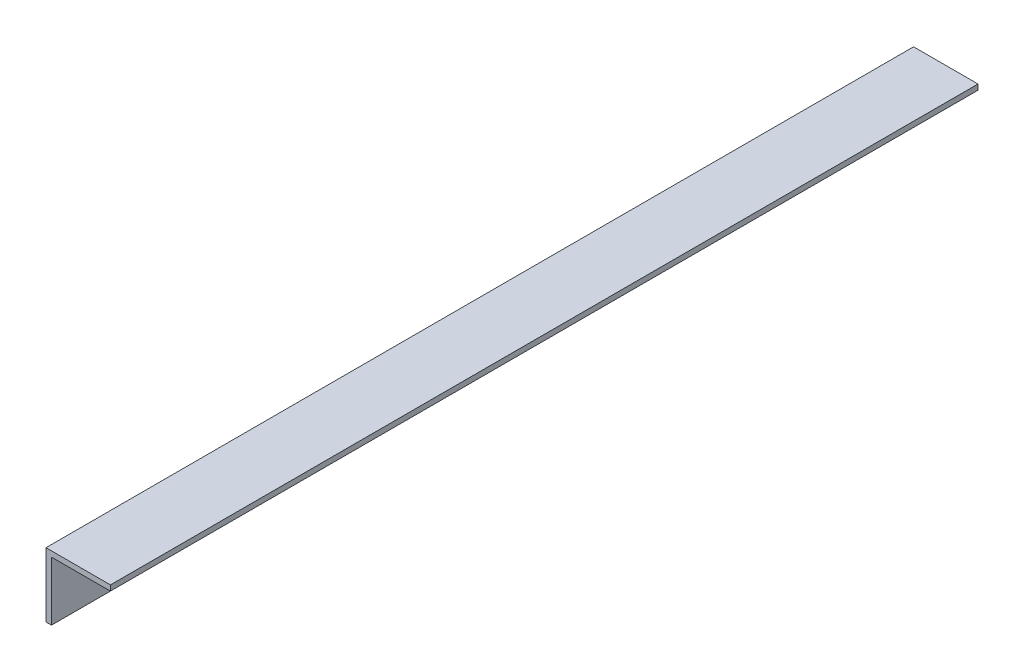
ISO-10303-21;
HEADER;
FILE_DESCRIPTION(('STEP AP214'),'2;1');
FILE_NAME('part.step','',(''),(''),'','','');
FILE_SCHEMA(('AUTOMOTIVE_DESIGN { 1 0 10303 214 1 1 1 1 }'));
ENDSEC;
DATA;
#1=APPLICATION_CONTEXT('core data for automotive mechanical design processes');
#2=APPLICATION_PROTOCOL_DEFINITION('international standard','automotive_design',2000,#1);
#3=PRODUCT_CONTEXT('',#1,'mechanical');
#4=PRODUCT('Part','Part','',(#3));
#5=PRODUCT_RELATED_PRODUCT_CATEGORY('part','',(#4));
#6=PRODUCT_DEFINITION_FORMATION('','',#4);
#7=PRODUCT_DEFINITION_CONTEXT('part definition',#1,'design');
#8=PRODUCT_DEFINITION('design','',#6,#7);
#9=PRODUCT_DEFINITION_SHAPE('','',#8);
#10=(LENGTH_UNIT() NAMED_UNIT(*) SI_UNIT(.MILLI.,.METRE.));
#11=(NAMED_UNIT(*) PLANE_ANGLE_UNIT() SI_UNIT($,.RADIAN.));
#12=(NAMED_UNIT(*) SI_UNIT($,.STERADIAN.) SOLID_ANGLE_UNIT());
#13=UNCERTAINTY_MEASURE_WITH_UNIT(LENGTH_MEASURE(1.E-05),#10,'distance_accuracy_value','');
#14=(GEOMETRIC_REPRESENTATION_CONTEXT(3) GLOBAL_UNCERTAINTY_ASSIGNED_CONTEXT((#13)) GLOBAL_UNIT_ASSIGNED_CONTEXT((#10,
#11,#12)) REPRESENTATION_CONTEXT('',''));
#15=CARTESIAN_POINT('',(0.,0.,0.));
#16=DIRECTION('',(0.,0.,1.));
#17=DIRECTION('',(1.,0.,0.));
#18=AXIS2_PLACEMENT_3D('',#15,#16,#17);
#19=CARTESIAN_POINT('',(0.,-1.6002,256.54));
#20=DIRECTION('',(-1.,0.,0.));
#21=DIRECTION('',(0.,0.,1.));
#22=AXIS2_PLACEMENT_3D('',#19,#20,#21);
#23=PLANE('',#22);
#24=DIRECTION('',(0.,1.,0.));
#25=VECTOR('',#24,1.);
#26=CARTESIAN_POINT('',(0.,-1.6002,0.));
#27=LINE('',#26,#25);
#28=CARTESIAN_POINT('',(0.,-1.6002,0.));
#29=VERTEX_POINT('',#28);
#30=CARTESIAN_POINT('',(0.,0.,0.));
#31=VERTEX_POINT('',#30);
#32=EDGE_CURVE('E119',#29,#31,#27,.T.);
#33=ORIENTED_EDGE('',*,*,#32,.T.);
#34=DIRECTION('',(0.,0.,-1.));
#35=VECTOR('',#34,1.);
#36=CARTESIAN_POINT('',(0.,0.,256.54));
#37=LINE('',#36,#35);
#38=CARTESIAN_POINT('',(0.,0.,256.54));
#39=VERTEX_POINT('',#38);
#40=EDGE_CURVE('E11',#39,#31,#37,.T.);
#41=ORIENTED_EDGE('',*,*,#40,.F.);
#42=DIRECTION('',(0.,1.,0.));
#43=VECTOR('',#42,1.);
#44=CARTESIAN_POINT('',(0.,-1.6002,256.54));
#45=LINE('',#44,#43);
#46=CARTESIAN_POINT('',(0.,-1.6002,256.54));
#47=VERTEX_POINT('',#46);
#48=EDGE_CURVE('E129',#47,#39,#45,.T.);
#49=ORIENTED_EDGE('',*,*,#48,.F.);
#50=DIRECTION('',(0.,0.,-1.));
#51=VECTOR('',#50,1.);
#52=CARTESIAN_POINT('',(0.,-1.6002,256.54));
#53=LINE('',#52,#51);
#54=EDGE_CURVE('E115',#47,#29,#53,.T.);
#55=ORIENTED_EDGE('',*,*,#54,.T.);
#56=EDGE_LOOP('',(#33,#41,#49,#55));
#57=FACE_BOUND('',#56,.T.);
#58=ADVANCED_FACE('F35',(#57),#23,.F.);
#59=CARTESIAN_POINT('',(0.,0.,256.54));
#60=DIRECTION('',(0.,-1.,0.));
#61=DIRECTION('',(1.,0.,0.));
#62=AXIS2_PLACEMENT_3D('',#59,#60,#61);
#63=PLANE('',#62);
#64=DIRECTION('',(-1.,0.,0.));
#65=VECTOR('',#64,1.);
#66=CARTESIAN_POINT('',(0.,0.,0.));
#67=LINE('',#66,#65);
#68=CARTESIAN_POINT('',(-19.05,0.,0.));
#69=VERTEX_POINT('',#68);
#70=EDGE_CURVE('E122',#31,#69,#67,.T.);
#71=ORIENTED_EDGE('',*,*,#70,.T.);
#72=DIRECTION('',(0.,0.,-1.));
#73=VECTOR('',#72,1.);
#74=CARTESIAN_POINT('',(-19.05,0.,256.54));
#75=LINE('',#74,#73);
#76=CARTESIAN_POINT('',(-19.05,0.,256.54));
#77=VERTEX_POINT('',#76);
#78=EDGE_CURVE('E43',#77,#69,#75,.T.);
#79=ORIENTED_EDGE('',*,*,#78,.F.);
#80=DIRECTION('',(-1.,0.,0.));
#81=VECTOR('',#80,1.);
#82=CARTESIAN_POINT('',(0.,0.,256.54));
#83=LINE('',#82,#81);
#84=EDGE_CURVE('E88',#39,#77,#83,.T.);
#85=ORIENTED_EDGE('',*,*,#84,.F.);
#86=ORIENTED_EDGE('',*,*,#40,.T.);
#87=EDGE_LOOP('',(#71,#79,#85,#86));
#88=FACE_BOUND('',#87,.T.);
#89=ADVANCED_FACE('F153',(#88),#63,.F.);
#90=CARTESIAN_POINT('',(-19.05,0.,256.54));
#91=DIRECTION('',(1.,0.,0.));
#92=DIRECTION('',(0.,1.,0.));
#93=AXIS2_PLACEMENT_3D('',#90,#91,#92);
#94=PLANE('',#93);
#95=DIRECTION('',(0.,-1.,0.));
#96=VECTOR('',#95,1.);
#97=CARTESIAN_POINT('',(-19.05,0.,0.));
#98=LINE('',#97,#96);
#99=CARTESIAN_POINT('',(-19.05,-19.05,0.));
#100=VERTEX_POINT('',#99);
#101=EDGE_CURVE('E124',#69,#100,#98,.T.);
#102=ORIENTED_EDGE('',*,*,#101,.T.);
#103=DIRECTION('',(0.,0.,-1.));
#104=VECTOR('',#103,1.);
#105=CARTESIAN_POINT('',(-19.05,-19.05,256.54));
#106=LINE('',#105,#104);
#107=CARTESIAN_POINT('',(-19.05,-19.05,256.54));
#108=VERTEX_POINT('',#107);
#109=EDGE_CURVE('E110',#108,#100,#106,.T.);
#110=ORIENTED_EDGE('',*,*,#109,.F.);
#111=DIRECTION('',(0.,-1.,0.));
#112=VECTOR('',#111,1.);
#113=CARTESIAN_POINT('',(-19.05,0.,256.54));
#114=LINE('',#113,#112);
#115=EDGE_CURVE('E101',#77,#108,#114,.T.);
#116=ORIENTED_EDGE('',*,*,#115,.F.);
#117=ORIENTED_EDGE('',*,*,#78,.T.);
#118=EDGE_LOOP('',(#102,#110,#116,#117));
#119=FACE_BOUND('',#118,.T.);
#120=ADVANCED_FACE('F135',(#119),#94,.F.);
#121=CARTESIAN_POINT('',(-19.05,-19.05,256.54));
#122=DIRECTION('',(0.,1.,0.));
#123=DIRECTION('',(0.,0.,1.));
#124=AXIS2_PLACEMENT_3D('',#121,#122,#123);
#125=PLANE('',#124);
#126=DIRECTION('',(1.,0.,0.));
#127=VECTOR('',#126,1.);
#128=CARTESIAN_POINT('',(-19.05,-19.05,0.));
#129=LINE('',#128,#127);
#130=CARTESIAN_POINT('',(-17.4498,-19.05,0.));
#131=VERTEX_POINT('',#130);
#132=EDGE_CURVE('E109',#100,#131,#129,.T.);
#133=ORIENTED_EDGE('',*,*,#132,.T.);
#134=DIRECTION('',(0.,0.,-1.));
#135=VECTOR('',#134,1.);
#136=CARTESIAN_POINT('',(-17.4498,-19.05,256.54));
#137=LINE('',#136,#135);
#138=CARTESIAN_POINT('',(-17.4498,-19.05,256.54));
#139=VERTEX_POINT('',#138);
#140=EDGE_CURVE('E106',#139,#131,#137,.T.);
#141=ORIENTED_EDGE('',*,*,#140,.F.);
#142=DIRECTION('',(1.,0.,0.));
#143=VECTOR('',#142,1.);
#144=CARTESIAN_POINT('',(-19.05,-19.05,256.54));
#145=LINE('',#144,#143);
#146=EDGE_CURVE('E95',#108,#139,#145,.T.);
#147=ORIENTED_EDGE('',*,*,#146,.F.);
#148=ORIENTED_EDGE('',*,*,#109,.T.);
#149=EDGE_LOOP('',(#133,#141,#147,#148));
#150=FACE_BOUND('',#149,.T.);
#151=ADVANCED_FACE('F107',(#150),#125,.F.);
#152=CARTESIAN_POINT('',(-17.4498,-19.05,256.54));
#153=DIRECTION('',(-1.,0.,0.));
#154=DIRECTION('',(0.,0.,1.));
#155=AXIS2_PLACEMENT_3D('',#152,#153,#154);
#156=PLANE('',#155);
#157=DIRECTION('',(0.,1.,0.));
#158=VECTOR('',#157,1.);
#159=CARTESIAN_POINT('',(-17.4498,-19.05,0.));
#160=LINE('',#159,#158);
#161=CARTESIAN_POINT('',(-17.4498,-1.6002,0.));
#162=VERTEX_POINT('',#161);
#163=EDGE_CURVE('E74',#131,#162,#160,.T.);
#164=ORIENTED_EDGE('',*,*,#163,.T.);
#165=DIRECTION('',(0.,0.,-1.));
#166=VECTOR('',#165,1.);
#167=CARTESIAN_POINT('',(-17.4498,-1.6002,256.54));
#168=LINE('',#167,#166);
#169=CARTESIAN_POINT('',(-17.4498,-1.6002,256.54));
#170=VERTEX_POINT('',#169);
#171=EDGE_CURVE('E111',#170,#162,#168,.T.);
#172=ORIENTED_EDGE('',*,*,#171,.F.);
#173=DIRECTION('',(0.,1.,0.));
#174=VECTOR('',#173,1.);
#175=CARTESIAN_POINT('',(-17.4498,-19.05,256.54));
#176=LINE('',#175,#174);
#177=EDGE_CURVE('E99',#139,#170,#176,.T.);
#178=ORIENTED_EDGE('',*,*,#177,.F.);
#179=ORIENTED_EDGE('',*,*,#140,.T.);
#180=EDGE_LOOP('',(#164,#172,#178,#179));
#181=FACE_BOUND('',#180,.T.);
#182=ADVANCED_FACE('F113',(#181),#156,.F.);
#183=CARTESIAN_POINT('',(-17.4498,-1.6002,256.54));
#184=DIRECTION('',(0.,1.,0.));
#185=DIRECTION('',(-1.,0.,0.));
#186=AXIS2_PLACEMENT_3D('',#183,#184,#185);
#187=PLANE('',#186);
#188=DIRECTION('',(1.,0.,0.));
#189=VECTOR('',#188,1.);
#190=CARTESIAN_POINT('',(-17.4498,-1.6002,0.));
#191=LINE('',#190,#189);
#192=EDGE_CURVE('E80',#162,#29,#191,.T.);
#193=ORIENTED_EDGE('',*,*,#192,.T.);
#194=ORIENTED_EDGE('',*,*,#54,.F.);
#195=DIRECTION('',(1.,0.,0.));
#196=VECTOR('',#195,1.);
#197=CARTESIAN_POINT('',(-17.4498,-1.6002,256.54));
#198=LINE('',#197,#196);
#199=EDGE_CURVE('E51',#170,#47,#198,.T.);
#200=ORIENTED_EDGE('',*,*,#199,.F.);
#201=ORIENTED_EDGE('',*,*,#171,.T.);
#202=EDGE_LOOP('',(#193,#194,#200,#201));
#203=FACE_BOUND('',#202,.T.);
#204=ADVANCED_FACE('F142',(#203),#187,.F.);
#205=CARTESIAN_POINT('',(0.,0.,256.54));
#206=DIRECTION('',(0.,0.,1.));
#207=DIRECTION('',(1.,0.,0.));
#208=AXIS2_PLACEMENT_3D('',#205,#206,#207);
#209=PLANE('',#208);
#210=ORIENTED_EDGE('',*,*,#48,.T.);
#211=ORIENTED_EDGE('',*,*,#84,.T.);
#212=ORIENTED_EDGE('',*,*,#115,.T.);
#213=ORIENTED_EDGE('',*,*,#146,.T.);
#214=ORIENTED_EDGE('',*,*,#177,.T.);
#215=ORIENTED_EDGE('',*,*,#199,.T.);
#216=EDGE_LOOP('',(#210,#211,#212,#213,#214,#215));
#217=FACE_BOUND('',#216,.T.);
#218=ADVANCED_FACE('F97',(#217),#209,.T.);
#219=CARTESIAN_POINT('',(0.,0.,0.));
#220=DIRECTION('',(0.,0.,1.));
#221=DIRECTION('',(1.,0.,0.));
#222=AXIS2_PLACEMENT_3D('',#219,#220,#221);
#223=PLANE('',#222);
#224=ORIENTED_EDGE('',*,*,#32,.F.);
#225=ORIENTED_EDGE('',*,*,#192,.F.);
#226=ORIENTED_EDGE('',*,*,#163,.F.);
#227=ORIENTED_EDGE('',*,*,#132,.F.);
#228=ORIENTED_EDGE('',*,*,#101,.F.);
#229=ORIENTED_EDGE('',*,*,#70,.F.);
#230=EDGE_LOOP('',(#224,#225,#226,#227,#228,#229));
#231=FACE_BOUND('',#230,.T.);
#232=ADVANCED_FACE('F138',(#231),#223,.F.);
#233=CLOSED_SHELL('',(#58,#89,#120,#151,#182,#204,#218,#232));
#234=MANIFOLD_SOLID_BREP('B2',#233);
#235=ADVANCED_BREP_SHAPE_REPRESENTATION('',(#18,#234),#14);
#236=SHAPE_DEFINITION_REPRESENTATION(#9,#235);
ENDSEC;
END-ISO-10303-21;
